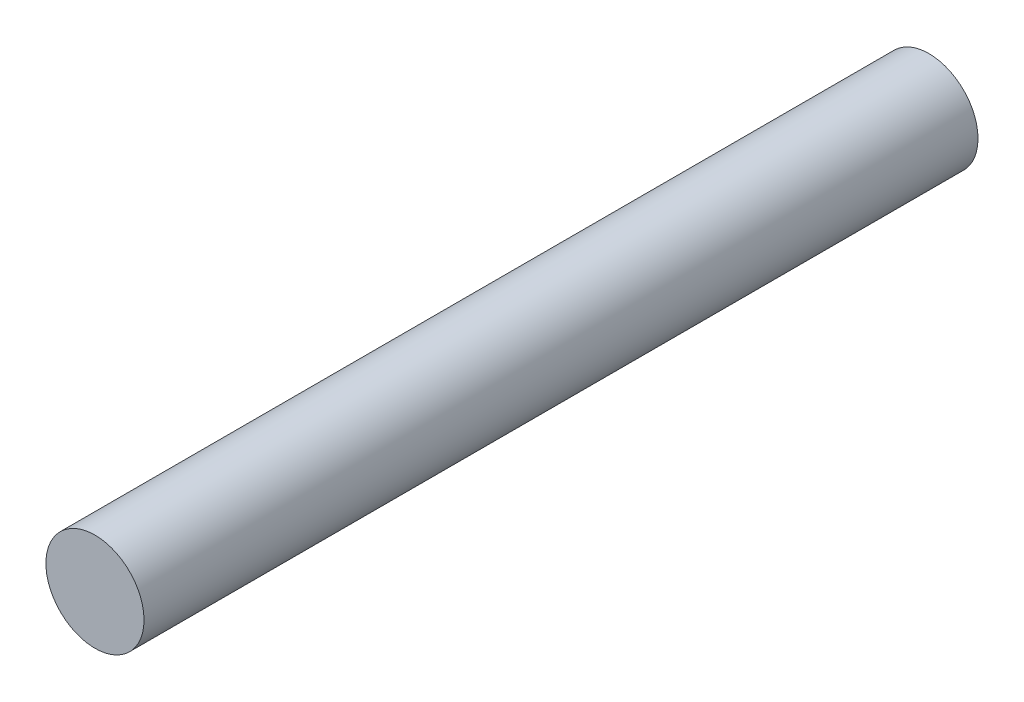
ISO-10303-21;
HEADER;
FILE_DESCRIPTION(('STEP AP214'),'2;1');
FILE_NAME('part.step','',(''),(''),'','','');
FILE_SCHEMA(('AUTOMOTIVE_DESIGN { 1 0 10303 214 1 1 1 1 }'));
ENDSEC;
DATA;
#1=APPLICATION_CONTEXT('core data for automotive mechanical design processes');
#2=APPLICATION_PROTOCOL_DEFINITION('international standard','automotive_design',2000,#1);
#3=PRODUCT_CONTEXT('',#1,'mechanical');
#4=PRODUCT('Part','Part','',(#3));
#5=PRODUCT_RELATED_PRODUCT_CATEGORY('part','',(#4));
#6=PRODUCT_DEFINITION_FORMATION('','',#4);
#7=PRODUCT_DEFINITION_CONTEXT('part definition',#1,'design');
#8=PRODUCT_DEFINITION('design','',#6,#7);
#9=PRODUCT_DEFINITION_SHAPE('','',#8);
#10=(LENGTH_UNIT() NAMED_UNIT(*) SI_UNIT(.MILLI.,.METRE.));
#11=(NAMED_UNIT(*) PLANE_ANGLE_UNIT() SI_UNIT($,.RADIAN.));
#12=(NAMED_UNIT(*) SI_UNIT($,.STERADIAN.) SOLID_ANGLE_UNIT());
#13=UNCERTAINTY_MEASURE_WITH_UNIT(LENGTH_MEASURE(1.E-05),#10,'distance_accuracy_value','');
#14=(GEOMETRIC_REPRESENTATION_CONTEXT(3) GLOBAL_UNCERTAINTY_ASSIGNED_CONTEXT((#13)) GLOBAL_UNIT_ASSIGNED_CONTEXT((#10,
#11,#12)) REPRESENTATION_CONTEXT('',''));
#15=CARTESIAN_POINT('',(0.,0.,0.));
#16=DIRECTION('',(0.,0.,1.));
#17=DIRECTION('',(1.,0.,0.));
#18=AXIS2_PLACEMENT_3D('',#15,#16,#17);
#19=CARTESIAN_POINT('',(0.,0.,42.5));
#20=DIRECTION('',(0.,0.,-1.));
#21=DIRECTION('',(-1.,0.,0.));
#22=AXIS2_PLACEMENT_3D('',#19,#20,#21);
#23=CYLINDRICAL_SURFACE('',#22,2.5);
#24=CARTESIAN_POINT('',(0.,0.,42.5));
#25=DIRECTION('',(0.,0.,1.));
#26=DIRECTION('',(1.,0.,0.));
#27=AXIS2_PLACEMENT_3D('',#24,#25,#26);
#28=CIRCLE('',#27,2.5);
#29=CARTESIAN_POINT('',(2.5,0.,42.5));
#30=VERTEX_POINT('',#29);
#31=EDGE_CURVE('E10',#30,#30,#28,.T.);
#32=ORIENTED_EDGE('',*,*,#31,.F.);
#33=EDGE_LOOP('',(#32));
#34=FACE_BOUND('',#33,.T.);
#35=CARTESIAN_POINT('',(0.,0.,0.));
#36=DIRECTION('',(0.,0.,1.));
#37=DIRECTION('',(1.,0.,0.));
#38=AXIS2_PLACEMENT_3D('',#35,#36,#37);
#39=CIRCLE('',#38,2.5);
#40=CARTESIAN_POINT('',(2.5,0.,0.));
#41=VERTEX_POINT('',#40);
#42=EDGE_CURVE('E40',#41,#41,#39,.T.);
#43=ORIENTED_EDGE('',*,*,#42,.T.);
#44=EDGE_LOOP('',(#43));
#45=FACE_BOUND('',#44,.T.);
#46=ADVANCED_FACE('F37',(#34,#45),#23,.T.);
#47=CARTESIAN_POINT('',(0.,0.,42.5));
#48=DIRECTION('',(0.,0.,1.));
#49=DIRECTION('',(1.,0.,0.));
#50=AXIS2_PLACEMENT_3D('',#47,#48,#49);
#51=PLANE('',#50);
#52=ORIENTED_EDGE('',*,*,#31,.T.);
#53=EDGE_LOOP('',(#52));
#54=FACE_BOUND('',#53,.T.);
#55=ADVANCED_FACE('F54',(#54),#51,.T.);
#56=CARTESIAN_POINT('',(0.,0.,0.));
#57=DIRECTION('',(0.,0.,1.));
#58=DIRECTION('',(1.,0.,0.));
#59=AXIS2_PLACEMENT_3D('',#56,#57,#58);
#60=PLANE('',#59);
#61=ORIENTED_EDGE('',*,*,#42,.F.);
#62=EDGE_LOOP('',(#61));
#63=FACE_BOUND('',#62,.T.);
#64=ADVANCED_FACE('F52',(#63),#60,.F.);
#65=CLOSED_SHELL('',(#46,#55,#64));
#66=MANIFOLD_SOLID_BREP('B2',#65);
#67=ADVANCED_BREP_SHAPE_REPRESENTATION('',(#18,#66),#14);
#68=SHAPE_DEFINITION_REPRESENTATION(#9,#67);
ENDSEC;
END-ISO-10303-21;
